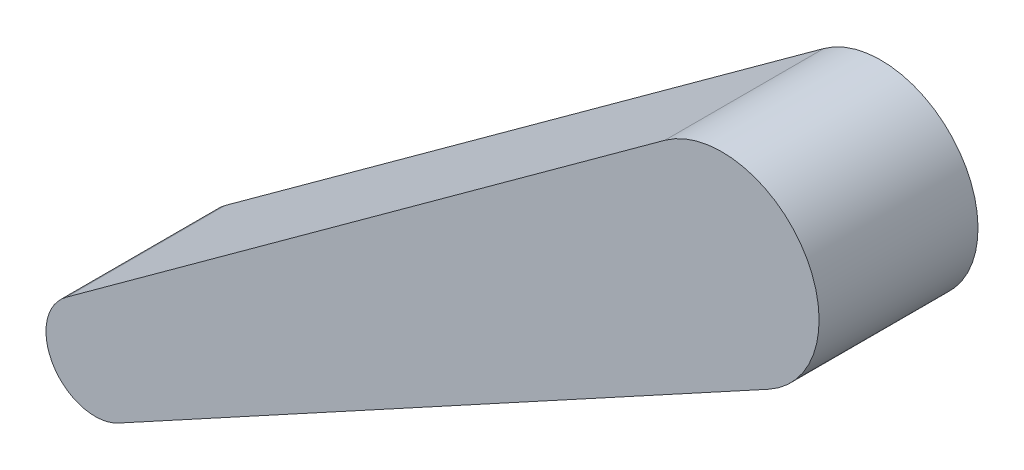
ISO-10303-21;
HEADER;
FILE_DESCRIPTION(('STEP AP214'),'2;1');
FILE_NAME('part.step','',(''),(''),'','','');
FILE_SCHEMA(('AUTOMOTIVE_DESIGN { 1 0 10303 214 1 1 1 1 }'));
ENDSEC;
DATA;
#1=APPLICATION_CONTEXT('core data for automotive mechanical design processes');
#2=APPLICATION_PROTOCOL_DEFINITION('international standard','automotive_design',2000,#1);
#3=PRODUCT_CONTEXT('',#1,'mechanical');
#4=PRODUCT('Part','Part','',(#3));
#5=PRODUCT_RELATED_PRODUCT_CATEGORY('part','',(#4));
#6=PRODUCT_DEFINITION_FORMATION('','',#4);
#7=PRODUCT_DEFINITION_CONTEXT('part definition',#1,'design');
#8=PRODUCT_DEFINITION('design','',#6,#7);
#9=PRODUCT_DEFINITION_SHAPE('','',#8);
#10=(LENGTH_UNIT() NAMED_UNIT(*) SI_UNIT(.MILLI.,.METRE.));
#11=(NAMED_UNIT(*) PLANE_ANGLE_UNIT() SI_UNIT($,.RADIAN.));
#12=(NAMED_UNIT(*) SI_UNIT($,.STERADIAN.) SOLID_ANGLE_UNIT());
#13=UNCERTAINTY_MEASURE_WITH_UNIT(LENGTH_MEASURE(1.E-05),#10,'distance_accuracy_value','');
#14=(GEOMETRIC_REPRESENTATION_CONTEXT(3) GLOBAL_UNCERTAINTY_ASSIGNED_CONTEXT((#13)) GLOBAL_UNIT_ASSIGNED_CONTEXT((#10,
#11,#12)) REPRESENTATION_CONTEXT('',''));
#15=CARTESIAN_POINT('',(0.,0.,0.));
#16=DIRECTION('',(0.,0.,1.));
#17=DIRECTION('',(1.,0.,0.));
#18=AXIS2_PLACEMENT_3D('',#15,#16,#17);
#19=CARTESIAN_POINT('',(-1958.42776523897,191.242174920571,-114.3));
#20=DIRECTION('',(0.,0.,1.));
#21=DIRECTION('',(1.,0.,0.));
#22=AXIS2_PLACEMENT_3D('',#19,#20,#21);
#23=CYLINDRICAL_SURFACE('',#22,35.3060000000001);
#24=CARTESIAN_POINT('',(-1958.42776523897,191.242174920571,0.));
#25=DIRECTION('',(0.,0.,1.));
#26=DIRECTION('',(1.,0.,0.));
#27=AXIS2_PLACEMENT_3D('',#24,#25,#26);
#28=CIRCLE('',#27,35.3060000000001);
#29=CARTESIAN_POINT('',(-1941.53148354724,160.241702327504,0.));
#30=VERTEX_POINT('',#29);
#31=CARTESIAN_POINT('',(-1979.1891875628,219.79873247031,0.));
#32=VERTEX_POINT('',#31);
#33=EDGE_CURVE('E100',#30,#32,#28,.F.);
#34=ORIENTED_EDGE('',*,*,#33,.T.);
#35=DIRECTION('',(0.,0.,1.));
#36=VECTOR('',#35,1.);
#37=CARTESIAN_POINT('',(-1979.1891875628,219.79873247031,-114.3));
#38=LINE('',#37,#36);
#39=CARTESIAN_POINT('',(-1979.1891875628,219.79873247031,-114.3));
#40=VERTEX_POINT('',#39);
#41=EDGE_CURVE('E11',#40,#32,#38,.T.);
#42=ORIENTED_EDGE('',*,*,#41,.F.);
#43=CARTESIAN_POINT('',(-1958.42776523897,191.242174920571,-114.3));
#44=DIRECTION('',(0.,0.,1.));
#45=DIRECTION('',(1.,0.,0.));
#46=AXIS2_PLACEMENT_3D('',#43,#44,#45);
#47=CIRCLE('',#46,35.3060000000001);
#48=CARTESIAN_POINT('',(-1941.53148354724,160.241702327504,-114.3));
#49=VERTEX_POINT('',#48);
#50=EDGE_CURVE('E55',#49,#40,#47,.F.);
#51=ORIENTED_EDGE('',*,*,#50,.F.);
#52=DIRECTION('',(0.,0.,1.));
#53=VECTOR('',#52,1.);
#54=CARTESIAN_POINT('',(-1941.53148354724,160.241702327504,-114.3));
#55=LINE('',#54,#53);
#56=EDGE_CURVE('E40',#49,#30,#55,.T.);
#57=ORIENTED_EDGE('',*,*,#56,.T.);
#58=EDGE_LOOP('',(#34,#42,#51,#57));
#59=FACE_BOUND('',#58,.T.);
#60=ADVANCED_FACE('F37',(#59),#23,.T.);
#61=CARTESIAN_POINT('',(-788.933374868276,1085.14826060242,-114.3));
#62=DIRECTION('',(-0.588042324925787,0.808830157756173,0.));
#63=DIRECTION('',(-0.808830157756173,-0.588042324925787,0.));
#64=AXIS2_PLACEMENT_3D('',#61,#62,#63);
#65=PLANE('',#64);
#66=DIRECTION('',(-0.808830157756173,-0.588042324925787,0.));
#67=VECTOR('',#66,1.);
#68=CARTESIAN_POINT('',(-788.933374868276,1085.14826060242,0.));
#69=LINE('',#68,#67);
#70=CARTESIAN_POINT('',(-1548.66486326828,532.802052348464,0.));
#71=VERTEX_POINT('',#70);
#72=EDGE_CURVE('E96',#71,#32,#69,.T.);
#73=ORIENTED_EDGE('',*,*,#72,.F.);
#74=DIRECTION('',(0.,0.,1.));
#75=VECTOR('',#74,1.);
#76=CARTESIAN_POINT('',(-1548.66486326828,532.802052348464,-114.3));
#77=LINE('',#76,#75);
#78=CARTESIAN_POINT('',(-1548.66486326828,532.802052348464,-114.3));
#79=VERTEX_POINT('',#78);
#80=EDGE_CURVE('E46',#79,#71,#77,.T.);
#81=ORIENTED_EDGE('',*,*,#80,.F.);
#82=DIRECTION('',(-0.808830157756173,-0.588042324925787,0.));
#83=VECTOR('',#82,1.);
#84=CARTESIAN_POINT('',(-788.933374868276,1085.14826060242,-114.3));
#85=LINE('',#84,#83);
#86=EDGE_CURVE('E85',#79,#40,#85,.T.);
#87=ORIENTED_EDGE('',*,*,#86,.T.);
#88=ORIENTED_EDGE('',*,*,#41,.T.);
#89=EDGE_LOOP('',(#73,#81,#87,#88));
#90=FACE_BOUND('',#89,.T.);
#91=ADVANCED_FACE('F110',(#90),#65,.T.);
#92=CARTESIAN_POINT('',(-1507.59010687222,476.305265829196,-114.3));
#93=DIRECTION('',(0.,0.,1.));
#94=DIRECTION('',(1.,0.,0.));
#95=AXIS2_PLACEMENT_3D('',#92,#93,#94);
#96=CYLINDRICAL_SURFACE('',#95,69.85);
#97=CARTESIAN_POINT('',(-1507.59010687222,476.305265829196,0.));
#98=DIRECTION('',(0.,0.,1.));
#99=DIRECTION('',(1.,0.,0.));
#100=AXIS2_PLACEMENT_3D('',#97,#98,#99);
#101=CIRCLE('',#100,69.85);
#102=CARTESIAN_POINT('',(-1474.16221143892,414.973395591114,0.));
#103=VERTEX_POINT('',#102);
#104=EDGE_CURVE('E90',#71,#103,#101,.F.);
#105=ORIENTED_EDGE('',*,*,#104,.T.);
#106=DIRECTION('',(0.,0.,1.));
#107=VECTOR('',#106,1.);
#108=CARTESIAN_POINT('',(-1474.16221143892,414.973395591114,-114.3));
#109=LINE('',#108,#107);
#110=CARTESIAN_POINT('',(-1474.16221143892,414.973395591114,-114.3));
#111=VERTEX_POINT('',#110);
#112=EDGE_CURVE('E88',#111,#103,#109,.T.);
#113=ORIENTED_EDGE('',*,*,#112,.F.);
#114=CARTESIAN_POINT('',(-1507.59010687222,476.305265829196,-114.3));
#115=DIRECTION('',(0.,0.,1.));
#116=DIRECTION('',(1.,0.,0.));
#117=AXIS2_PLACEMENT_3D('',#114,#115,#116);
#118=CIRCLE('',#117,69.85);
#119=EDGE_CURVE('E82',#79,#111,#118,.F.);
#120=ORIENTED_EDGE('',*,*,#119,.F.);
#121=ORIENTED_EDGE('',*,*,#80,.T.);
#122=EDGE_LOOP('',(#105,#113,#120,#121));
#123=FACE_BOUND('',#122,.T.);
#124=ADVANCED_FACE('F89',(#123),#96,.T.);
#125=CARTESIAN_POINT('',(-511.996213088489,939.385650711896,-114.3));
#126=DIRECTION('',(-0.478566863755078,0.878051112928871,0.));
#127=DIRECTION('',(-0.878051112928871,-0.478566863755078,0.));
#128=AXIS2_PLACEMENT_3D('',#125,#126,#127);
#129=PLANE('',#128);
#130=DIRECTION('',(-0.878051112928871,-0.478566863755078,0.));
#131=VECTOR('',#130,1.);
#132=CARTESIAN_POINT('',(-511.996213088489,939.385650711896,0.));
#133=LINE('',#132,#131);
#134=EDGE_CURVE('E102',#103,#30,#133,.T.);
#135=ORIENTED_EDGE('',*,*,#134,.T.);
#136=ORIENTED_EDGE('',*,*,#56,.F.);
#137=DIRECTION('',(-0.878051112928871,-0.478566863755078,0.));
#138=VECTOR('',#137,1.);
#139=CARTESIAN_POINT('',(-511.996213088489,939.385650711896,-114.3));
#140=LINE('',#139,#138);
#141=EDGE_CURVE('E80',#111,#49,#140,.T.);
#142=ORIENTED_EDGE('',*,*,#141,.F.);
#143=ORIENTED_EDGE('',*,*,#112,.T.);
#144=EDGE_LOOP('',(#135,#136,#142,#143));
#145=FACE_BOUND('',#144,.T.);
#146=ADVANCED_FACE('F93',(#145),#129,.F.);
#147=CARTESIAN_POINT('',(0.,0.,-114.3));
#148=DIRECTION('',(0.,0.,1.));
#149=DIRECTION('',(1.,0.,0.));
#150=AXIS2_PLACEMENT_3D('',#147,#148,#149);
#151=PLANE('',#150);
#152=ORIENTED_EDGE('',*,*,#50,.T.);
#153=ORIENTED_EDGE('',*,*,#86,.F.);
#154=ORIENTED_EDGE('',*,*,#119,.T.);
#155=ORIENTED_EDGE('',*,*,#141,.T.);
#156=EDGE_LOOP('',(#152,#153,#154,#155));
#157=FACE_BOUND('',#156,.T.);
#158=ADVANCED_FACE('F84',(#157),#151,.F.);
#159=CARTESIAN_POINT('',(0.,0.,0.));
#160=DIRECTION('',(0.,0.,1.));
#161=DIRECTION('',(1.,0.,0.));
#162=AXIS2_PLACEMENT_3D('',#159,#160,#161);
#163=PLANE('',#162);
#164=ORIENTED_EDGE('',*,*,#33,.F.);
#165=ORIENTED_EDGE('',*,*,#134,.F.);
#166=ORIENTED_EDGE('',*,*,#104,.F.);
#167=ORIENTED_EDGE('',*,*,#72,.T.);
#168=EDGE_LOOP('',(#164,#165,#166,#167));
#169=FACE_BOUND('',#168,.T.);
#170=ADVANCED_FACE('F109',(#169),#163,.T.);
#171=CLOSED_SHELL('',(#60,#91,#124,#146,#158,#170));
#172=MANIFOLD_SOLID_BREP('B2',#171);
#173=ADVANCED_BREP_SHAPE_REPRESENTATION('',(#18,#172),#14);
#174=SHAPE_DEFINITION_REPRESENTATION(#9,#173);
ENDSEC;
END-ISO-10303-21;
